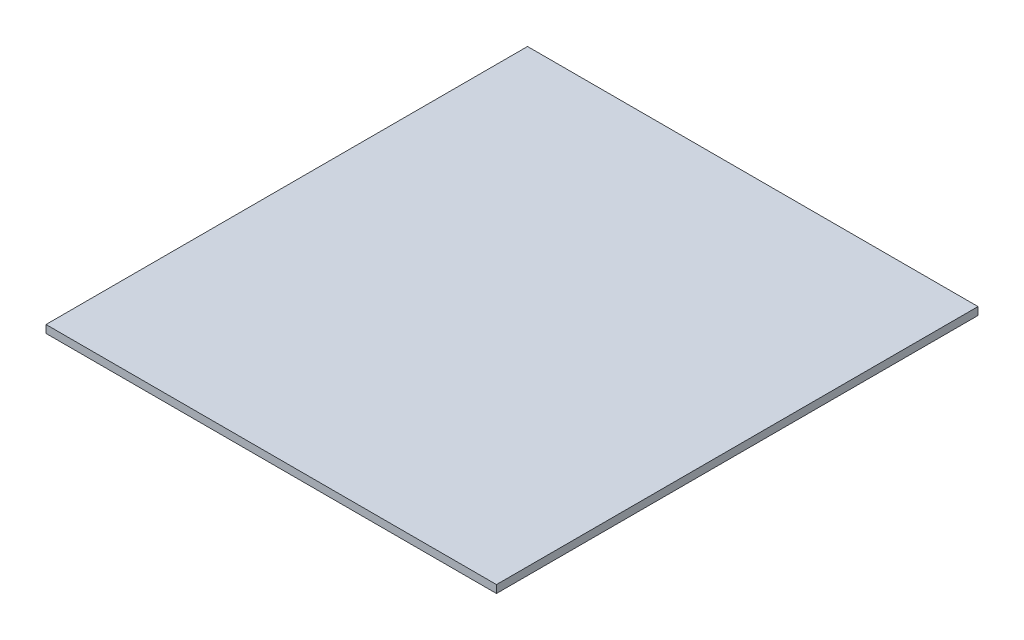
ISO-10303-21;
HEADER;
FILE_DESCRIPTION(('STEP AP214'),'2;1');
FILE_NAME('part.step','',(''),(''),'','','');
FILE_SCHEMA(('AUTOMOTIVE_DESIGN { 1 0 10303 214 1 1 1 1 }'));
ENDSEC;
DATA;
#1=APPLICATION_CONTEXT('core data for automotive mechanical design processes');
#2=APPLICATION_PROTOCOL_DEFINITION('international standard','automotive_design',2000,#1);
#3=PRODUCT_CONTEXT('',#1,'mechanical');
#4=PRODUCT('Part','Part','',(#3));
#5=PRODUCT_RELATED_PRODUCT_CATEGORY('part','',(#4));
#6=PRODUCT_DEFINITION_FORMATION('','',#4);
#7=PRODUCT_DEFINITION_CONTEXT('part definition',#1,'design');
#8=PRODUCT_DEFINITION('design','',#6,#7);
#9=PRODUCT_DEFINITION_SHAPE('','',#8);
#10=(LENGTH_UNIT() NAMED_UNIT(*) SI_UNIT(.MILLI.,.METRE.));
#11=(NAMED_UNIT(*) PLANE_ANGLE_UNIT() SI_UNIT($,.RADIAN.));
#12=(NAMED_UNIT(*) SI_UNIT($,.STERADIAN.) SOLID_ANGLE_UNIT());
#13=UNCERTAINTY_MEASURE_WITH_UNIT(LENGTH_MEASURE(1.E-05),#10,'distance_accuracy_value','');
#14=(GEOMETRIC_REPRESENTATION_CONTEXT(3) GLOBAL_UNCERTAINTY_ASSIGNED_CONTEXT((#13)) GLOBAL_UNIT_ASSIGNED_CONTEXT((#10,
#11,#12)) REPRESENTATION_CONTEXT('',''));
#15=CARTESIAN_POINT('',(0.,0.,0.));
#16=DIRECTION('',(0.,0.,1.));
#17=DIRECTION('',(1.,0.,0.));
#18=AXIS2_PLACEMENT_3D('',#15,#16,#17);
#19=CARTESIAN_POINT('',(-184.15,6.35,196.85));
#20=DIRECTION('',(1.,0.,0.));
#21=DIRECTION('',(0.,0.,-1.));
#22=AXIS2_PLACEMENT_3D('',#19,#20,#21);
#23=PLANE('',#22);
#24=DIRECTION('',(0.,0.,1.));
#25=VECTOR('',#24,1.);
#26=CARTESIAN_POINT('',(-184.15,0.,196.85));
#27=LINE('',#26,#25);
#28=CARTESIAN_POINT('',(-184.15,0.,-196.85));
#29=VERTEX_POINT('',#28);
#30=CARTESIAN_POINT('',(-184.15,0.,196.85));
#31=VERTEX_POINT('',#30);
#32=EDGE_CURVE('E96',#29,#31,#27,.T.);
#33=ORIENTED_EDGE('',*,*,#32,.T.);
#34=DIRECTION('',(0.,-1.,0.));
#35=VECTOR('',#34,1.);
#36=CARTESIAN_POINT('',(-184.15,6.35,196.85));
#37=LINE('',#36,#35);
#38=CARTESIAN_POINT('',(-184.15,6.35,196.85));
#39=VERTEX_POINT('',#38);
#40=EDGE_CURVE('E11',#39,#31,#37,.T.);
#41=ORIENTED_EDGE('',*,*,#40,.F.);
#42=DIRECTION('',(0.,0.,1.));
#43=VECTOR('',#42,1.);
#44=CARTESIAN_POINT('',(-184.15,6.35,196.85));
#45=LINE('',#44,#43);
#46=CARTESIAN_POINT('',(-184.15,6.35,-196.85));
#47=VERTEX_POINT('',#46);
#48=EDGE_CURVE('E84',#47,#39,#45,.T.);
#49=ORIENTED_EDGE('',*,*,#48,.F.);
#50=DIRECTION('',(0.,-1.,0.));
#51=VECTOR('',#50,1.);
#52=CARTESIAN_POINT('',(-184.15,6.35,-196.85));
#53=LINE('',#52,#51);
#54=EDGE_CURVE('E92',#47,#29,#53,.T.);
#55=ORIENTED_EDGE('',*,*,#54,.T.);
#56=EDGE_LOOP('',(#33,#41,#49,#55));
#57=FACE_BOUND('',#56,.T.);
#58=ADVANCED_FACE('F33',(#57),#23,.F.);
#59=CARTESIAN_POINT('',(184.15,6.35,196.85));
#60=DIRECTION('',(0.,0.,-1.));
#61=DIRECTION('',(-1.,0.,0.));
#62=AXIS2_PLACEMENT_3D('',#59,#60,#61);
#63=PLANE('',#62);
#64=DIRECTION('',(1.,0.,0.));
#65=VECTOR('',#64,1.);
#66=CARTESIAN_POINT('',(184.15,0.,196.85));
#67=LINE('',#66,#65);
#68=CARTESIAN_POINT('',(184.15,0.,196.85));
#69=VERTEX_POINT('',#68);
#70=EDGE_CURVE('E88',#31,#69,#67,.T.);
#71=ORIENTED_EDGE('',*,*,#70,.T.);
#72=DIRECTION('',(0.,-1.,0.));
#73=VECTOR('',#72,1.);
#74=CARTESIAN_POINT('',(184.15,6.35,196.85));
#75=LINE('',#74,#73);
#76=CARTESIAN_POINT('',(184.15,6.35,196.85));
#77=VERTEX_POINT('',#76);
#78=EDGE_CURVE('E41',#77,#69,#75,.T.);
#79=ORIENTED_EDGE('',*,*,#78,.F.);
#80=DIRECTION('',(1.,0.,0.));
#81=VECTOR('',#80,1.);
#82=CARTESIAN_POINT('',(184.15,6.35,196.85));
#83=LINE('',#82,#81);
#84=EDGE_CURVE('E79',#39,#77,#83,.T.);
#85=ORIENTED_EDGE('',*,*,#84,.F.);
#86=ORIENTED_EDGE('',*,*,#40,.T.);
#87=EDGE_LOOP('',(#71,#79,#85,#86));
#88=FACE_BOUND('',#87,.T.);
#89=ADVANCED_FACE('F87',(#88),#63,.F.);
#90=CARTESIAN_POINT('',(184.15,6.35,196.85));
#91=DIRECTION('',(-1.,0.,0.));
#92=DIRECTION('',(0.,0.,1.));
#93=AXIS2_PLACEMENT_3D('',#90,#91,#92);
#94=PLANE('',#93);
#95=DIRECTION('',(0.,0.,-1.));
#96=VECTOR('',#95,1.);
#97=CARTESIAN_POINT('',(184.15,0.,196.85));
#98=LINE('',#97,#96);
#99=CARTESIAN_POINT('',(184.15,0.,-196.85));
#100=VERTEX_POINT('',#99);
#101=EDGE_CURVE('E66',#69,#100,#98,.T.);
#102=ORIENTED_EDGE('',*,*,#101,.T.);
#103=DIRECTION('',(0.,-1.,0.));
#104=VECTOR('',#103,1.);
#105=CARTESIAN_POINT('',(184.15,6.35,-196.85));
#106=LINE('',#105,#104);
#107=CARTESIAN_POINT('',(184.15,6.35,-196.85));
#108=VERTEX_POINT('',#107);
#109=EDGE_CURVE('E89',#108,#100,#106,.T.);
#110=ORIENTED_EDGE('',*,*,#109,.F.);
#111=DIRECTION('',(0.,0.,-1.));
#112=VECTOR('',#111,1.);
#113=CARTESIAN_POINT('',(184.15,6.35,196.85));
#114=LINE('',#113,#112);
#115=EDGE_CURVE('E82',#77,#108,#114,.T.);
#116=ORIENTED_EDGE('',*,*,#115,.F.);
#117=ORIENTED_EDGE('',*,*,#78,.T.);
#118=EDGE_LOOP('',(#102,#110,#116,#117));
#119=FACE_BOUND('',#118,.T.);
#120=ADVANCED_FACE('F90',(#119),#94,.F.);
#121=CARTESIAN_POINT('',(184.15,6.35,-196.85));
#122=DIRECTION('',(0.,0.,1.));
#123=DIRECTION('',(1.,0.,0.));
#124=AXIS2_PLACEMENT_3D('',#121,#122,#123);
#125=PLANE('',#124);
#126=DIRECTION('',(-1.,0.,0.));
#127=VECTOR('',#126,1.);
#128=CARTESIAN_POINT('',(184.15,0.,-196.85));
#129=LINE('',#128,#127);
#130=EDGE_CURVE('E72',#100,#29,#129,.T.);
#131=ORIENTED_EDGE('',*,*,#130,.T.);
#132=ORIENTED_EDGE('',*,*,#54,.F.);
#133=DIRECTION('',(-1.,0.,0.));
#134=VECTOR('',#133,1.);
#135=CARTESIAN_POINT('',(184.15,6.35,-196.85));
#136=LINE('',#135,#134);
#137=EDGE_CURVE('E49',#108,#47,#136,.T.);
#138=ORIENTED_EDGE('',*,*,#137,.F.);
#139=ORIENTED_EDGE('',*,*,#109,.T.);
#140=EDGE_LOOP('',(#131,#132,#138,#139));
#141=FACE_BOUND('',#140,.T.);
#142=ADVANCED_FACE('F103',(#141),#125,.F.);
#143=CARTESIAN_POINT('',(0.,6.35,0.));
#144=DIRECTION('',(0.,1.,0.));
#145=DIRECTION('',(0.,0.,1.));
#146=AXIS2_PLACEMENT_3D('',#143,#144,#145);
#147=PLANE('',#146);
#148=ORIENTED_EDGE('',*,*,#48,.T.);
#149=ORIENTED_EDGE('',*,*,#84,.T.);
#150=ORIENTED_EDGE('',*,*,#115,.T.);
#151=ORIENTED_EDGE('',*,*,#137,.T.);
#152=EDGE_LOOP('',(#148,#149,#150,#151));
#153=FACE_BOUND('',#152,.T.);
#154=ADVANCED_FACE('F80',(#153),#147,.T.);
#155=CARTESIAN_POINT('',(0.,0.,0.));
#156=DIRECTION('',(0.,1.,0.));
#157=DIRECTION('',(0.,0.,1.));
#158=AXIS2_PLACEMENT_3D('',#155,#156,#157);
#159=PLANE('',#158);
#160=ORIENTED_EDGE('',*,*,#32,.F.);
#161=ORIENTED_EDGE('',*,*,#130,.F.);
#162=ORIENTED_EDGE('',*,*,#101,.F.);
#163=ORIENTED_EDGE('',*,*,#70,.F.);
#164=EDGE_LOOP('',(#160,#161,#162,#163));
#165=FACE_BOUND('',#164,.T.);
#166=ADVANCED_FACE('F106',(#165),#159,.F.);
#167=CLOSED_SHELL('',(#58,#89,#120,#142,#154,#166));
#168=MANIFOLD_SOLID_BREP('B2',#167);
#169=ADVANCED_BREP_SHAPE_REPRESENTATION('',(#18,#168),#14);
#170=SHAPE_DEFINITION_REPRESENTATION(#9,#169);
ENDSEC;
END-ISO-10303-21;
